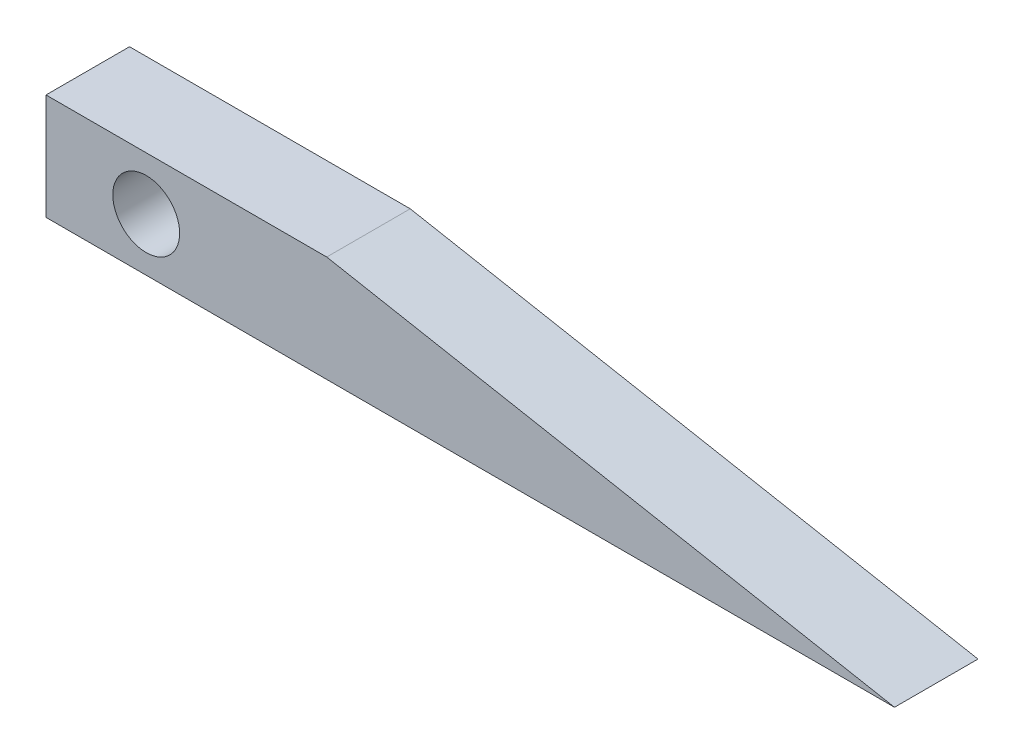
ISO-10303-21;
HEADER;
FILE_DESCRIPTION(('STEP AP214'),'2;1');
FILE_NAME('part.step','',(''),(''),'','','');
FILE_SCHEMA(('AUTOMOTIVE_DESIGN { 1 0 10303 214 1 1 1 1 }'));
ENDSEC;
DATA;
#1=APPLICATION_CONTEXT('core data for automotive mechanical design processes');
#2=APPLICATION_PROTOCOL_DEFINITION('international standard','automotive_design',2000,#1);
#3=PRODUCT_CONTEXT('',#1,'mechanical');
#4=PRODUCT('Part','Part','',(#3));
#5=PRODUCT_RELATED_PRODUCT_CATEGORY('part','',(#4));
#6=PRODUCT_DEFINITION_FORMATION('','',#4);
#7=PRODUCT_DEFINITION_CONTEXT('part definition',#1,'design');
#8=PRODUCT_DEFINITION('design','',#6,#7);
#9=PRODUCT_DEFINITION_SHAPE('','',#8);
#10=(LENGTH_UNIT() NAMED_UNIT(*) SI_UNIT(.MILLI.,.METRE.));
#11=(NAMED_UNIT(*) PLANE_ANGLE_UNIT() SI_UNIT($,.RADIAN.));
#12=(NAMED_UNIT(*) SI_UNIT($,.STERADIAN.) SOLID_ANGLE_UNIT());
#13=UNCERTAINTY_MEASURE_WITH_UNIT(LENGTH_MEASURE(1.E-05),#10,'distance_accuracy_value','');
#14=(GEOMETRIC_REPRESENTATION_CONTEXT(3) GLOBAL_UNCERTAINTY_ASSIGNED_CONTEXT((#13)) GLOBAL_UNIT_ASSIGNED_CONTEXT((#10,
#11,#12)) REPRESENTATION_CONTEXT('',''));
#15=CARTESIAN_POINT('',(0.,0.,0.));
#16=DIRECTION('',(0.,0.,1.));
#17=DIRECTION('',(1.,0.,0.));
#18=AXIS2_PLACEMENT_3D('',#15,#16,#17);
#19=CARTESIAN_POINT('',(0.,6.35,5.));
#20=DIRECTION('',(1.,0.,0.));
#21=DIRECTION('',(0.,0.,-1.));
#22=AXIS2_PLACEMENT_3D('',#19,#20,#21);
#23=PLANE('',#22);
#24=DIRECTION('',(0.,-1.,0.));
#25=VECTOR('',#24,1.);
#26=CARTESIAN_POINT('',(0.,6.35,0.));
#27=LINE('',#26,#25);
#28=CARTESIAN_POINT('',(0.,6.35,0.));
#29=VERTEX_POINT('',#28);
#30=CARTESIAN_POINT('',(0.,0.,0.));
#31=VERTEX_POINT('',#30);
#32=EDGE_CURVE('E93',#29,#31,#27,.T.);
#33=ORIENTED_EDGE('',*,*,#32,.T.);
#34=DIRECTION('',(0.,0.,-1.));
#35=VECTOR('',#34,1.);
#36=CARTESIAN_POINT('',(0.,0.,5.));
#37=LINE('',#36,#35);
#38=CARTESIAN_POINT('',(0.,0.,5.));
#39=VERTEX_POINT('',#38);
#40=EDGE_CURVE('E11',#39,#31,#37,.T.);
#41=ORIENTED_EDGE('',*,*,#40,.F.);
#42=DIRECTION('',(0.,-1.,0.));
#43=VECTOR('',#42,1.);
#44=CARTESIAN_POINT('',(0.,6.35,5.));
#45=LINE('',#44,#43);
#46=CARTESIAN_POINT('',(0.,6.35,5.));
#47=VERTEX_POINT('',#46);
#48=EDGE_CURVE('E87',#47,#39,#45,.T.);
#49=ORIENTED_EDGE('',*,*,#48,.F.);
#50=DIRECTION('',(0.,0.,-1.));
#51=VECTOR('',#50,1.);
#52=CARTESIAN_POINT('',(0.,6.35,5.));
#53=LINE('',#52,#51);
#54=EDGE_CURVE('E81',#47,#29,#53,.T.);
#55=ORIENTED_EDGE('',*,*,#54,.T.);
#56=EDGE_LOOP('',(#33,#41,#49,#55));
#57=FACE_BOUND('',#56,.T.);
#58=ADVANCED_FACE('F42',(#57),#23,.F.);
#59=CARTESIAN_POINT('',(0.,0.,5.));
#60=DIRECTION('',(0.,1.,0.));
#61=DIRECTION('',(0.,0.,1.));
#62=AXIS2_PLACEMENT_3D('',#59,#60,#61);
#63=PLANE('',#62);
#64=DIRECTION('',(1.,0.,0.));
#65=VECTOR('',#64,1.);
#66=CARTESIAN_POINT('',(0.,0.,0.));
#67=LINE('',#66,#65);
#68=CARTESIAN_POINT('',(50.8,0.,0.));
#69=VERTEX_POINT('',#68);
#70=EDGE_CURVE('E88',#31,#69,#67,.T.);
#71=ORIENTED_EDGE('',*,*,#70,.T.);
#72=DIRECTION('',(0.,0.,-1.));
#73=VECTOR('',#72,1.);
#74=CARTESIAN_POINT('',(50.8,0.,5.));
#75=LINE('',#74,#73);
#76=CARTESIAN_POINT('',(50.8,0.,5.));
#77=VERTEX_POINT('',#76);
#78=EDGE_CURVE('E50',#77,#69,#75,.T.);
#79=ORIENTED_EDGE('',*,*,#78,.F.);
#80=DIRECTION('',(1.,0.,0.));
#81=VECTOR('',#80,1.);
#82=CARTESIAN_POINT('',(0.,0.,5.));
#83=LINE('',#82,#81);
#84=EDGE_CURVE('E105',#39,#77,#83,.T.);
#85=ORIENTED_EDGE('',*,*,#84,.F.);
#86=ORIENTED_EDGE('',*,*,#40,.T.);
#87=EDGE_LOOP('',(#71,#79,#85,#86));
#88=FACE_BOUND('',#87,.T.);
#89=ADVANCED_FACE('F120',(#88),#63,.F.);
#90=CARTESIAN_POINT('',(0.,6.35,5.));
#91=DIRECTION('',(0.,-1.,0.));
#92=DIRECTION('',(0.,0.,-1.));
#93=AXIS2_PLACEMENT_3D('',#90,#91,#92);
#94=PLANE('',#93);
#95=DIRECTION('',(-1.,0.,0.));
#96=VECTOR('',#95,1.);
#97=CARTESIAN_POINT('',(0.,6.35,5.));
#98=LINE('',#97,#96);
#99=CARTESIAN_POINT('',(16.8070339977788,6.35,5.));
#100=VERTEX_POINT('',#99);
#101=EDGE_CURVE('E58',#100,#47,#98,.T.);
#102=ORIENTED_EDGE('',*,*,#101,.F.);
#103=DIRECTION('',(0.,0.,-1.));
#104=VECTOR('',#103,1.);
#105=CARTESIAN_POINT('',(16.8070339977788,6.35,39.5809808656169));
#106=LINE('',#105,#104);
#107=CARTESIAN_POINT('',(16.8070339977788,6.35,0.));
#108=VERTEX_POINT('',#107);
#109=EDGE_CURVE('E84',#100,#108,#106,.T.);
#110=ORIENTED_EDGE('',*,*,#109,.T.);
#111=DIRECTION('',(-1.,0.,0.));
#112=VECTOR('',#111,1.);
#113=CARTESIAN_POINT('',(0.,6.35,0.));
#114=LINE('',#113,#112);
#115=EDGE_CURVE('E78',#108,#29,#114,.T.);
#116=ORIENTED_EDGE('',*,*,#115,.T.);
#117=ORIENTED_EDGE('',*,*,#54,.F.);
#118=EDGE_LOOP('',(#102,#110,#116,#117));
#119=FACE_BOUND('',#118,.T.);
#120=ADVANCED_FACE('F80',(#119),#94,.F.);
#121=CARTESIAN_POINT('',(0.,0.,5.));
#122=DIRECTION('',(0.,0.,1.));
#123=DIRECTION('',(1.,0.,0.));
#124=AXIS2_PLACEMENT_3D('',#121,#122,#123);
#125=PLANE('',#124);
#126=DIRECTION('',(-0.982996003910913,0.183626948717168,0.));
#127=VECTOR('',#126,1.);
#128=CARTESIAN_POINT('',(50.8,0.,5.));
#129=LINE('',#128,#127);
#130=EDGE_CURVE('E112',#77,#100,#129,.T.);
#131=ORIENTED_EDGE('',*,*,#130,.T.);
#132=ORIENTED_EDGE('',*,*,#101,.T.);
#133=ORIENTED_EDGE('',*,*,#48,.T.);
#134=ORIENTED_EDGE('',*,*,#84,.T.);
#135=EDGE_LOOP('',(#131,#132,#133,#134));
#136=FACE_BOUND('',#135,.T.);
#137=CARTESIAN_POINT('',(6.,3.175,5.));
#138=DIRECTION('',(0.,0.,1.));
#139=DIRECTION('',(1.,0.,0.));
#140=AXIS2_PLACEMENT_3D('',#137,#138,#139);
#141=CIRCLE('',#140,2.);
#142=CARTESIAN_POINT('',(8.,3.175,5.));
#143=VERTEX_POINT('',#142);
#144=EDGE_CURVE('E97',#143,#143,#141,.F.);
#145=ORIENTED_EDGE('',*,*,#144,.T.);
#146=EDGE_LOOP('',(#145));
#147=FACE_BOUND('',#146,.T.);
#148=ADVANCED_FACE('F121',(#136,#147),#125,.T.);
#149=CARTESIAN_POINT('',(0.,0.,0.));
#150=DIRECTION('',(0.,0.,1.));
#151=DIRECTION('',(1.,0.,0.));
#152=AXIS2_PLACEMENT_3D('',#149,#150,#151);
#153=PLANE('',#152);
#154=CARTESIAN_POINT('',(6.,3.175,0.));
#155=DIRECTION('',(0.,0.,-1.));
#156=DIRECTION('',(-1.,0.,0.));
#157=AXIS2_PLACEMENT_3D('',#154,#155,#156);
#158=CIRCLE('',#157,2.);
#159=CARTESIAN_POINT('',(4.,3.175,0.));
#160=VERTEX_POINT('',#159);
#161=EDGE_CURVE('E101',#160,#160,#158,.T.);
#162=ORIENTED_EDGE('',*,*,#161,.F.);
#163=EDGE_LOOP('',(#162));
#164=FACE_BOUND('',#163,.T.);
#165=ORIENTED_EDGE('',*,*,#115,.F.);
#166=DIRECTION('',(-0.982996003910912,0.183626948717168,0.));
#167=VECTOR('',#166,1.);
#168=CARTESIAN_POINT('',(50.8,0.,0.));
#169=LINE('',#168,#167);
#170=EDGE_CURVE('E114',#69,#108,#169,.T.);
#171=ORIENTED_EDGE('',*,*,#170,.F.);
#172=ORIENTED_EDGE('',*,*,#70,.F.);
#173=ORIENTED_EDGE('',*,*,#32,.F.);
#174=EDGE_LOOP('',(#165,#171,#172,#173));
#175=FACE_BOUND('',#174,.T.);
#176=ADVANCED_FACE('F95',(#164,#175),#153,.F.);
#177=CARTESIAN_POINT('',(6.,3.175,10.6568542494924));
#178=DIRECTION('',(0.,0.,-1.));
#179=DIRECTION('',(-1.,0.,0.));
#180=AXIS2_PLACEMENT_3D('',#177,#178,#179);
#181=CYLINDRICAL_SURFACE('',#180,2.);
#182=ORIENTED_EDGE('',*,*,#161,.T.);
#183=EDGE_LOOP('',(#182));
#184=FACE_BOUND('',#183,.T.);
#185=ORIENTED_EDGE('',*,*,#144,.F.);
#186=EDGE_LOOP('',(#185));
#187=FACE_BOUND('',#186,.T.);
#188=ADVANCED_FACE('F127',(#184,#187),#181,.F.);
#189=CARTESIAN_POINT('',(50.8,0.,39.5809808656169));
#190=DIRECTION('',(-0.183626948717168,-0.982996003910912,0.));
#191=DIRECTION('',(0.982996003910913,-0.183626948717168,0.));
#192=AXIS2_PLACEMENT_3D('',#189,#190,#191);
#193=PLANE('',#192);
#194=ORIENTED_EDGE('',*,*,#78,.T.);
#195=ORIENTED_EDGE('',*,*,#170,.T.);
#196=ORIENTED_EDGE('',*,*,#109,.F.);
#197=ORIENTED_EDGE('',*,*,#130,.F.);
#198=EDGE_LOOP('',(#194,#195,#196,#197));
#199=FACE_BOUND('',#198,.T.);
#200=ADVANCED_FACE('F115',(#199),#193,.F.);
#201=CLOSED_SHELL('',(#58,#89,#120,#148,#176,#188,#200));
#202=MANIFOLD_SOLID_BREP('B2',#201);
#203=ADVANCED_BREP_SHAPE_REPRESENTATION('',(#18,#202),#14);
#204=SHAPE_DEFINITION_REPRESENTATION(#9,#203);
ENDSEC;
END-ISO-10303-21;
